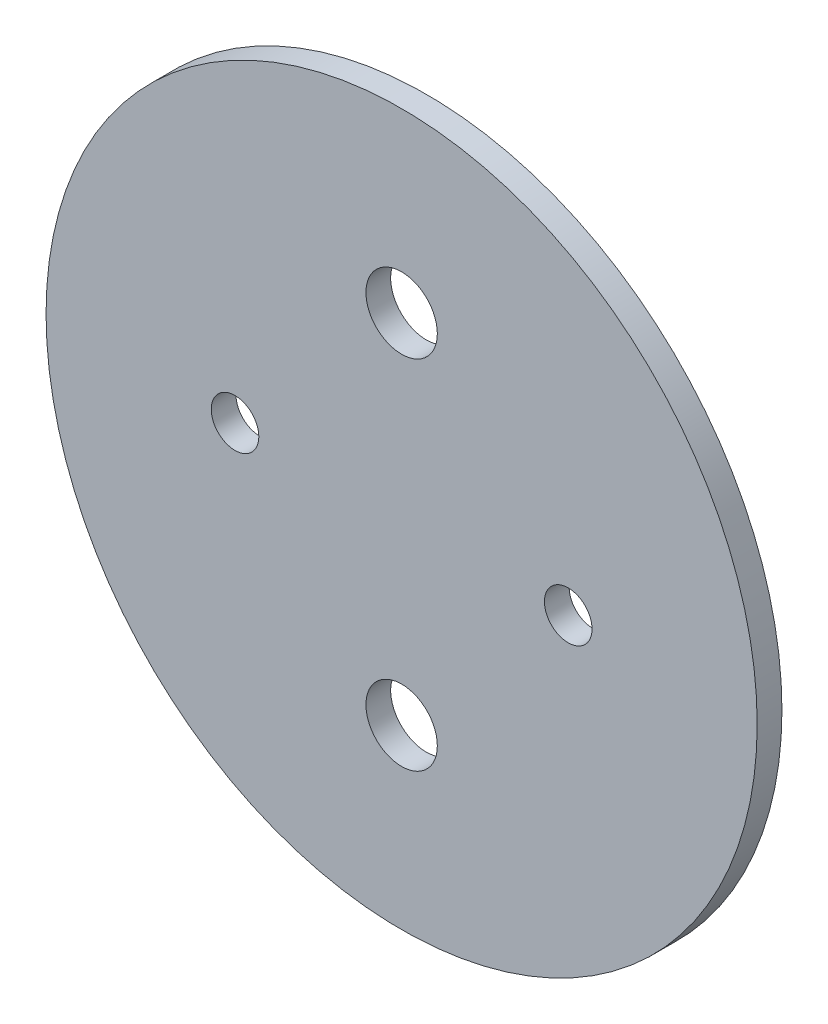
ISO-10303-21;
HEADER;
FILE_DESCRIPTION(('STEP AP214'),'2;1');
FILE_NAME('part.step','',(''),(''),'','','');
FILE_SCHEMA(('AUTOMOTIVE_DESIGN { 1 0 10303 214 1 1 1 1 }'));
ENDSEC;
DATA;
#1=APPLICATION_CONTEXT('core data for automotive mechanical design processes');
#2=APPLICATION_PROTOCOL_DEFINITION('international standard','automotive_design',2000,#1);
#3=PRODUCT_CONTEXT('',#1,'mechanical');
#4=PRODUCT('Part','Part','',(#3));
#5=PRODUCT_RELATED_PRODUCT_CATEGORY('part','',(#4));
#6=PRODUCT_DEFINITION_FORMATION('','',#4);
#7=PRODUCT_DEFINITION_CONTEXT('part definition',#1,'design');
#8=PRODUCT_DEFINITION('design','',#6,#7);
#9=PRODUCT_DEFINITION_SHAPE('','',#8);
#10=(LENGTH_UNIT() NAMED_UNIT(*) SI_UNIT(.MILLI.,.METRE.));
#11=(NAMED_UNIT(*) PLANE_ANGLE_UNIT() SI_UNIT($,.RADIAN.));
#12=(NAMED_UNIT(*) SI_UNIT($,.STERADIAN.) SOLID_ANGLE_UNIT());
#13=UNCERTAINTY_MEASURE_WITH_UNIT(LENGTH_MEASURE(1.E-05),#10,'distance_accuracy_value','');
#14=(GEOMETRIC_REPRESENTATION_CONTEXT(3) GLOBAL_UNCERTAINTY_ASSIGNED_CONTEXT((#13)) GLOBAL_UNIT_ASSIGNED_CONTEXT((#10,
#11,#12)) REPRESENTATION_CONTEXT('',''));
#15=CARTESIAN_POINT('',(0.,0.,0.));
#16=DIRECTION('',(0.,0.,1.));
#17=DIRECTION('',(1.,0.,0.));
#18=AXIS2_PLACEMENT_3D('',#15,#16,#17);
#19=CARTESIAN_POINT('',(0.,0.,3.302));
#20=DIRECTION('',(0.,0.,1.));
#21=DIRECTION('',(1.,0.,0.));
#22=AXIS2_PLACEMENT_3D('',#19,#20,#21);
#23=PLANE('',#22);
#24=CARTESIAN_POINT('',(0.,-23.8125,3.302));
#25=DIRECTION('',(0.,0.,1.));
#26=DIRECTION('',(1.,0.,0.));
#27=AXIS2_PLACEMENT_3D('',#24,#25,#26);
#28=CIRCLE('',#27,4.7625);
#29=CARTESIAN_POINT('',(4.76250000000001,-23.8125,3.302));
#30=VERTEX_POINT('',#29);
#31=EDGE_CURVE('E63',#30,#30,#28,.T.);
#32=ORIENTED_EDGE('',*,*,#31,.F.);
#33=EDGE_LOOP('',(#32));
#34=FACE_BOUND('',#33,.T.);
#35=CARTESIAN_POINT('',(-22.225,0.,3.302));
#36=DIRECTION('',(0.,0.,1.));
#37=DIRECTION('',(1.,0.,0.));
#38=AXIS2_PLACEMENT_3D('',#35,#36,#37);
#39=CIRCLE('',#38,3.175);
#40=CARTESIAN_POINT('',(-19.05,0.,3.302));
#41=VERTEX_POINT('',#40);
#42=EDGE_CURVE('E52',#41,#41,#39,.T.);
#43=ORIENTED_EDGE('',*,*,#42,.F.);
#44=EDGE_LOOP('',(#43));
#45=FACE_BOUND('',#44,.T.);
#46=CARTESIAN_POINT('',(0.,0.,3.302));
#47=DIRECTION('',(0.,0.,1.));
#48=DIRECTION('',(1.,0.,0.));
#49=AXIS2_PLACEMENT_3D('',#46,#47,#48);
#50=CIRCLE('',#49,47.4345);
#51=CARTESIAN_POINT('',(47.4345,0.,3.302));
#52=VERTEX_POINT('',#51);
#53=EDGE_CURVE('E10',#52,#52,#50,.T.);
#54=ORIENTED_EDGE('',*,*,#53,.T.);
#55=EDGE_LOOP('',(#54));
#56=FACE_BOUND('',#55,.T.);
#57=CARTESIAN_POINT('',(22.225,0.,3.302));
#58=DIRECTION('',(0.,0.,1.));
#59=DIRECTION('',(1.,0.,0.));
#60=AXIS2_PLACEMENT_3D('',#57,#58,#59);
#61=CIRCLE('',#60,3.175);
#62=CARTESIAN_POINT('',(25.4,0.,3.302));
#63=VERTEX_POINT('',#62);
#64=EDGE_CURVE('E57',#63,#63,#61,.T.);
#65=ORIENTED_EDGE('',*,*,#64,.F.);
#66=EDGE_LOOP('',(#65));
#67=FACE_BOUND('',#66,.T.);
#68=CARTESIAN_POINT('',(0.,23.8125,3.302));
#69=DIRECTION('',(0.,0.,1.));
#70=DIRECTION('',(1.,0.,0.));
#71=AXIS2_PLACEMENT_3D('',#68,#69,#70);
#72=CIRCLE('',#71,4.7625);
#73=CARTESIAN_POINT('',(4.76249999999999,23.8125,3.302));
#74=VERTEX_POINT('',#73);
#75=EDGE_CURVE('E69',#74,#74,#72,.T.);
#76=ORIENTED_EDGE('',*,*,#75,.F.);
#77=EDGE_LOOP('',(#76));
#78=FACE_BOUND('',#77,.T.);
#79=ADVANCED_FACE('F41',(#34,#45,#56,#67,#78),#23,.T.);
#80=CARTESIAN_POINT('',(0.,0.,0.));
#81=DIRECTION('',(0.,0.,1.));
#82=DIRECTION('',(1.,0.,0.));
#83=AXIS2_PLACEMENT_3D('',#80,#81,#82);
#84=PLANE('',#83);
#85=CARTESIAN_POINT('',(0.,0.,0.));
#86=DIRECTION('',(0.,0.,1.));
#87=DIRECTION('',(1.,0.,0.));
#88=AXIS2_PLACEMENT_3D('',#85,#86,#87);
#89=CIRCLE('',#88,47.4345);
#90=CARTESIAN_POINT('',(47.4345,0.,0.));
#91=VERTEX_POINT('',#90);
#92=EDGE_CURVE('E45',#91,#91,#89,.T.);
#93=ORIENTED_EDGE('',*,*,#92,.F.);
#94=EDGE_LOOP('',(#93));
#95=FACE_BOUND('',#94,.T.);
#96=CARTESIAN_POINT('',(-22.225,0.,0.));
#97=DIRECTION('',(0.,0.,1.));
#98=DIRECTION('',(1.,0.,0.));
#99=AXIS2_PLACEMENT_3D('',#96,#97,#98);
#100=CIRCLE('',#99,3.175);
#101=CARTESIAN_POINT('',(-19.05,0.,0.));
#102=VERTEX_POINT('',#101);
#103=EDGE_CURVE('E54',#102,#102,#100,.T.);
#104=ORIENTED_EDGE('',*,*,#103,.T.);
#105=EDGE_LOOP('',(#104));
#106=FACE_BOUND('',#105,.T.);
#107=CARTESIAN_POINT('',(22.225,0.,0.));
#108=DIRECTION('',(0.,0.,1.));
#109=DIRECTION('',(1.,0.,0.));
#110=AXIS2_PLACEMENT_3D('',#107,#108,#109);
#111=CIRCLE('',#110,3.175);
#112=CARTESIAN_POINT('',(25.4,0.,0.));
#113=VERTEX_POINT('',#112);
#114=EDGE_CURVE('E60',#113,#113,#111,.T.);
#115=ORIENTED_EDGE('',*,*,#114,.T.);
#116=EDGE_LOOP('',(#115));
#117=FACE_BOUND('',#116,.T.);
#118=CARTESIAN_POINT('',(0.,-23.8125,0.));
#119=DIRECTION('',(0.,0.,1.));
#120=DIRECTION('',(1.,0.,0.));
#121=AXIS2_PLACEMENT_3D('',#118,#119,#120);
#122=CIRCLE('',#121,4.7625);
#123=CARTESIAN_POINT('',(4.76250000000001,-23.8125,0.));
#124=VERTEX_POINT('',#123);
#125=EDGE_CURVE('E66',#124,#124,#122,.T.);
#126=ORIENTED_EDGE('',*,*,#125,.T.);
#127=EDGE_LOOP('',(#126));
#128=FACE_BOUND('',#127,.T.);
#129=CARTESIAN_POINT('',(0.,23.8125,0.));
#130=DIRECTION('',(0.,0.,1.));
#131=DIRECTION('',(1.,0.,0.));
#132=AXIS2_PLACEMENT_3D('',#129,#130,#131);
#133=CIRCLE('',#132,4.7625);
#134=CARTESIAN_POINT('',(4.76249999999999,23.8125,0.));
#135=VERTEX_POINT('',#134);
#136=EDGE_CURVE('E72',#135,#135,#133,.T.);
#137=ORIENTED_EDGE('',*,*,#136,.T.);
#138=EDGE_LOOP('',(#137));
#139=FACE_BOUND('',#138,.T.);
#140=ADVANCED_FACE('F82',(#95,#106,#117,#128,#139),#84,.F.);
#141=CARTESIAN_POINT('',(0.,0.,3.302));
#142=DIRECTION('',(0.,0.,-1.));
#143=DIRECTION('',(-1.,0.,0.));
#144=AXIS2_PLACEMENT_3D('',#141,#142,#143);
#145=CYLINDRICAL_SURFACE('',#144,47.4345);
#146=ORIENTED_EDGE('',*,*,#53,.F.);
#147=EDGE_LOOP('',(#146));
#148=FACE_BOUND('',#147,.T.);
#149=ORIENTED_EDGE('',*,*,#92,.T.);
#150=EDGE_LOOP('',(#149));
#151=FACE_BOUND('',#150,.T.);
#152=ADVANCED_FACE('F43',(#148,#151),#145,.T.);
#153=CARTESIAN_POINT('',(-22.225,0.,3.302));
#154=DIRECTION('',(0.,0.,-1.));
#155=DIRECTION('',(-1.,0.,0.));
#156=AXIS2_PLACEMENT_3D('',#153,#154,#155);
#157=CYLINDRICAL_SURFACE('',#156,3.175);
#158=ORIENTED_EDGE('',*,*,#42,.T.);
#159=EDGE_LOOP('',(#158));
#160=FACE_BOUND('',#159,.T.);
#161=ORIENTED_EDGE('',*,*,#103,.F.);
#162=EDGE_LOOP('',(#161));
#163=FACE_BOUND('',#162,.T.);
#164=ADVANCED_FACE('F92',(#160,#163),#157,.F.);
#165=CARTESIAN_POINT('',(22.225,0.,3.302));
#166=DIRECTION('',(0.,0.,-1.));
#167=DIRECTION('',(-1.,0.,0.));
#168=AXIS2_PLACEMENT_3D('',#165,#166,#167);
#169=CYLINDRICAL_SURFACE('',#168,3.175);
#170=ORIENTED_EDGE('',*,*,#64,.T.);
#171=EDGE_LOOP('',(#170));
#172=FACE_BOUND('',#171,.T.);
#173=ORIENTED_EDGE('',*,*,#114,.F.);
#174=EDGE_LOOP('',(#173));
#175=FACE_BOUND('',#174,.T.);
#176=ADVANCED_FACE('F95',(#172,#175),#169,.F.);
#177=CARTESIAN_POINT('',(0.,-23.8125,3.302));
#178=DIRECTION('',(0.,0.,-1.));
#179=DIRECTION('',(-1.,0.,0.));
#180=AXIS2_PLACEMENT_3D('',#177,#178,#179);
#181=CYLINDRICAL_SURFACE('',#180,4.7625);
#182=ORIENTED_EDGE('',*,*,#31,.T.);
#183=EDGE_LOOP('',(#182));
#184=FACE_BOUND('',#183,.T.);
#185=ORIENTED_EDGE('',*,*,#125,.F.);
#186=EDGE_LOOP('',(#185));
#187=FACE_BOUND('',#186,.T.);
#188=ADVANCED_FACE('F99',(#184,#187),#181,.F.);
#189=CARTESIAN_POINT('',(0.,23.8125,3.302));
#190=DIRECTION('',(0.,0.,-1.));
#191=DIRECTION('',(-1.,0.,0.));
#192=AXIS2_PLACEMENT_3D('',#189,#190,#191);
#193=CYLINDRICAL_SURFACE('',#192,4.7625);
#194=ORIENTED_EDGE('',*,*,#75,.T.);
#195=EDGE_LOOP('',(#194));
#196=FACE_BOUND('',#195,.T.);
#197=ORIENTED_EDGE('',*,*,#136,.F.);
#198=EDGE_LOOP('',(#197));
#199=FACE_BOUND('',#198,.T.);
#200=ADVANCED_FACE('F78',(#196,#199),#193,.F.);
#201=CLOSED_SHELL('',(#79,#140,#152,#164,#176,#188,#200));
#202=MANIFOLD_SOLID_BREP('B2',#201);
#203=ADVANCED_BREP_SHAPE_REPRESENTATION('',(#18,#202),#14);
#204=SHAPE_DEFINITION_REPRESENTATION(#9,#203);
ENDSEC;
END-ISO-10303-21;
